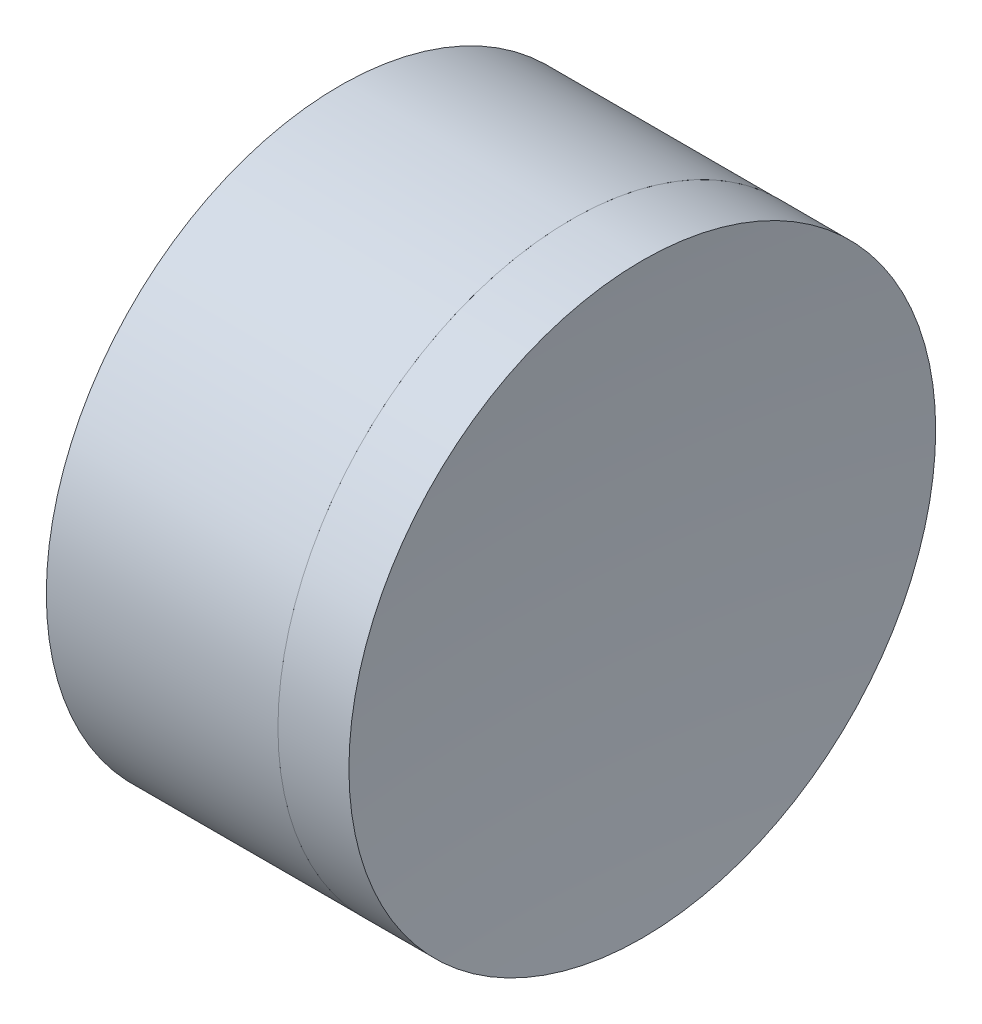
ISO-10303-21;
HEADER;
FILE_DESCRIPTION(('STEP AP214'),'2;1');
FILE_NAME('part.step','',(''),(''),'','','');
FILE_SCHEMA(('AUTOMOTIVE_DESIGN { 1 0 10303 214 1 1 1 1 }'));
ENDSEC;
DATA;
#1=APPLICATION_CONTEXT('core data for automotive mechanical design processes');
#2=APPLICATION_PROTOCOL_DEFINITION('international standard','automotive_design',2000,#1);
#3=PRODUCT_CONTEXT('',#1,'mechanical');
#4=PRODUCT('Part','Part','',(#3));
#5=PRODUCT_RELATED_PRODUCT_CATEGORY('part','',(#4));
#6=PRODUCT_DEFINITION_FORMATION('','',#4);
#7=PRODUCT_DEFINITION_CONTEXT('part definition',#1,'design');
#8=PRODUCT_DEFINITION('design','',#6,#7);
#9=PRODUCT_DEFINITION_SHAPE('','',#8);
#10=(LENGTH_UNIT() NAMED_UNIT(*) SI_UNIT(.MILLI.,.METRE.));
#11=(NAMED_UNIT(*) PLANE_ANGLE_UNIT() SI_UNIT($,.RADIAN.));
#12=(NAMED_UNIT(*) SI_UNIT($,.STERADIAN.) SOLID_ANGLE_UNIT());
#13=UNCERTAINTY_MEASURE_WITH_UNIT(LENGTH_MEASURE(1.E-05),#10,'distance_accuracy_value','');
#14=(GEOMETRIC_REPRESENTATION_CONTEXT(3) GLOBAL_UNCERTAINTY_ASSIGNED_CONTEXT((#13)) GLOBAL_UNIT_ASSIGNED_CONTEXT((#10,
#11,#12)) REPRESENTATION_CONTEXT('',''));
#15=CARTESIAN_POINT('',(0.,0.,0.));
#16=DIRECTION('',(0.,0.,1.));
#17=DIRECTION('',(1.,0.,0.));
#18=AXIS2_PLACEMENT_3D('',#15,#16,#17);
#19=CARTESIAN_POINT('',(245.725479542131,0.,0.));
#20=DIRECTION('',(-1.,0.,0.));
#21=DIRECTION('',(0.,0.,1.));
#22=AXIS2_PLACEMENT_3D('',#19,#20,#21);
#23=SPHERICAL_SURFACE('',#22,17.97);
#24=CARTESIAN_POINT('',(228.87738172665,0.,0.));
#25=DIRECTION('',(-1.,0.,0.));
#26=DIRECTION('',(0.,0.,1.));
#27=AXIS2_PLACEMENT_3D('',#24,#25,#26);
#28=CIRCLE('',#27,6.25000000000001);
#29=CARTESIAN_POINT('',(228.87738172665,0.,6.25000000000001));
#30=VERTEX_POINT('',#29);
#31=EDGE_CURVE('E11',#30,#30,#28,.T.);
#32=ORIENTED_EDGE('',*,*,#31,.T.);
#33=EDGE_LOOP('',(#32));
#34=FACE_BOUND('',#33,.T.);
#35=ADVANCED_FACE('F45',(#34),#23,.T.);
#36=CARTESIAN_POINT('',(223.943161323557,0.,0.));
#37=DIRECTION('',(-1.,0.,0.));
#38=DIRECTION('',(0.,0.,1.));
#39=AXIS2_PLACEMENT_3D('',#36,#37,#38);
#40=CYLINDRICAL_SURFACE('',#39,6.25000000000001);
#41=CARTESIAN_POINT('',(230.389390078191,0.,0.));
#42=DIRECTION('',(-1.,0.,0.));
#43=DIRECTION('',(0.,0.,1.));
#44=AXIS2_PLACEMENT_3D('',#41,#42,#43);
#45=CIRCLE('',#44,6.25);
#46=CARTESIAN_POINT('',(230.389390078191,0.,6.25));
#47=VERTEX_POINT('',#46);
#48=EDGE_CURVE('E51',#47,#47,#45,.T.);
#49=ORIENTED_EDGE('',*,*,#48,.T.);
#50=EDGE_LOOP('',(#49));
#51=FACE_BOUND('',#50,.T.);
#52=ORIENTED_EDGE('',*,*,#31,.F.);
#53=EDGE_LOOP('',(#52));
#54=FACE_BOUND('',#53,.T.);
#55=ADVANCED_FACE('F57',(#51,#54),#40,.T.);
#56=CARTESIAN_POINT('',(296.69547954213,0.,0.));
#57=DIRECTION('',(-1.,0.,0.));
#58=DIRECTION('',(0.,0.,-1.));
#59=AXIS2_PLACEMENT_3D('',#56,#57,#58);
#60=SPHERICAL_SURFACE('',#59,66.6);
#61=ORIENTED_EDGE('',*,*,#48,.F.);
#62=EDGE_LOOP('',(#61));
#63=FACE_BOUND('',#62,.T.);
#64=ADVANCED_FACE('F60',(#63),#60,.F.);
#65=CLOSED_SHELL('',(#35,#55,#64));
#66=MANIFOLD_SOLID_BREP('B2',#65);
#67=CARTESIAN_POINT('',(200.30547954213,0.,0.));
#68=DIRECTION('',(-1.,0.,0.));
#69=DIRECTION('',(0.,0.,1.));
#70=AXIS2_PLACEMENT_3D('',#67,#68,#69);
#71=SPHERICAL_SURFACE('',#70,24.45);
#72=CARTESIAN_POINT('',(223.943161323557,0.,0.));
#73=DIRECTION('',(-1.,0.,0.));
#74=DIRECTION('',(0.,0.,1.));
#75=AXIS2_PLACEMENT_3D('',#72,#73,#74);
#76=CIRCLE('',#75,6.25000000000004);
#77=CARTESIAN_POINT('',(223.943161323557,0.,6.25));
#78=VERTEX_POINT('',#77);
#79=EDGE_CURVE('E44',#78,#78,#76,.T.);
#80=ORIENTED_EDGE('',*,*,#79,.T.);
#81=EDGE_LOOP('',(#80));
#82=FACE_BOUND('',#81,.T.);
#83=ADVANCED_FACE('F86',(#82),#71,.F.);
#84=CARTESIAN_POINT('',(-0.816062176165804,0.,0.));
#85=DIRECTION('',(-1.,0.,0.));
#86=DIRECTION('',(0.,0.,1.));
#87=AXIS2_PLACEMENT_3D('',#84,#85,#86);
#88=CYLINDRICAL_SURFACE('',#87,6.25000000000004);
#89=CARTESIAN_POINT('',(228.87738172665,0.,0.));
#90=DIRECTION('',(-1.,0.,0.));
#91=DIRECTION('',(0.,0.,1.));
#92=AXIS2_PLACEMENT_3D('',#89,#90,#91);
#93=CIRCLE('',#92,6.25000000000004);
#94=CARTESIAN_POINT('',(228.87738172665,0.,6.25));
#95=VERTEX_POINT('',#94);
#96=EDGE_CURVE('E92',#95,#95,#93,.T.);
#97=ORIENTED_EDGE('',*,*,#96,.T.);
#98=EDGE_LOOP('',(#97));
#99=FACE_BOUND('',#98,.T.);
#100=ORIENTED_EDGE('',*,*,#79,.F.);
#101=EDGE_LOOP('',(#100));
#102=FACE_BOUND('',#101,.T.);
#103=ADVANCED_FACE('F98',(#99,#102),#88,.T.);
#104=CARTESIAN_POINT('',(245.725479542131,0.,0.));
#105=DIRECTION('',(-1.,0.,0.));
#106=DIRECTION('',(0.,0.,-1.));
#107=AXIS2_PLACEMENT_3D('',#104,#105,#106);
#108=SPHERICAL_SURFACE('',#107,17.97);
#109=ORIENTED_EDGE('',*,*,#96,.F.);
#110=EDGE_LOOP('',(#109));
#111=FACE_BOUND('',#110,.T.);
#112=ADVANCED_FACE('F101',(#111),#108,.F.);
#113=CLOSED_SHELL('',(#83,#103,#112));
#114=MANIFOLD_SOLID_BREP('B6',#113);
#115=ADVANCED_BREP_SHAPE_REPRESENTATION('',(#18,#66,#114),#14);
#116=SHAPE_DEFINITION_REPRESENTATION(#9,#115);
ENDSEC;
END-ISO-10303-21;
